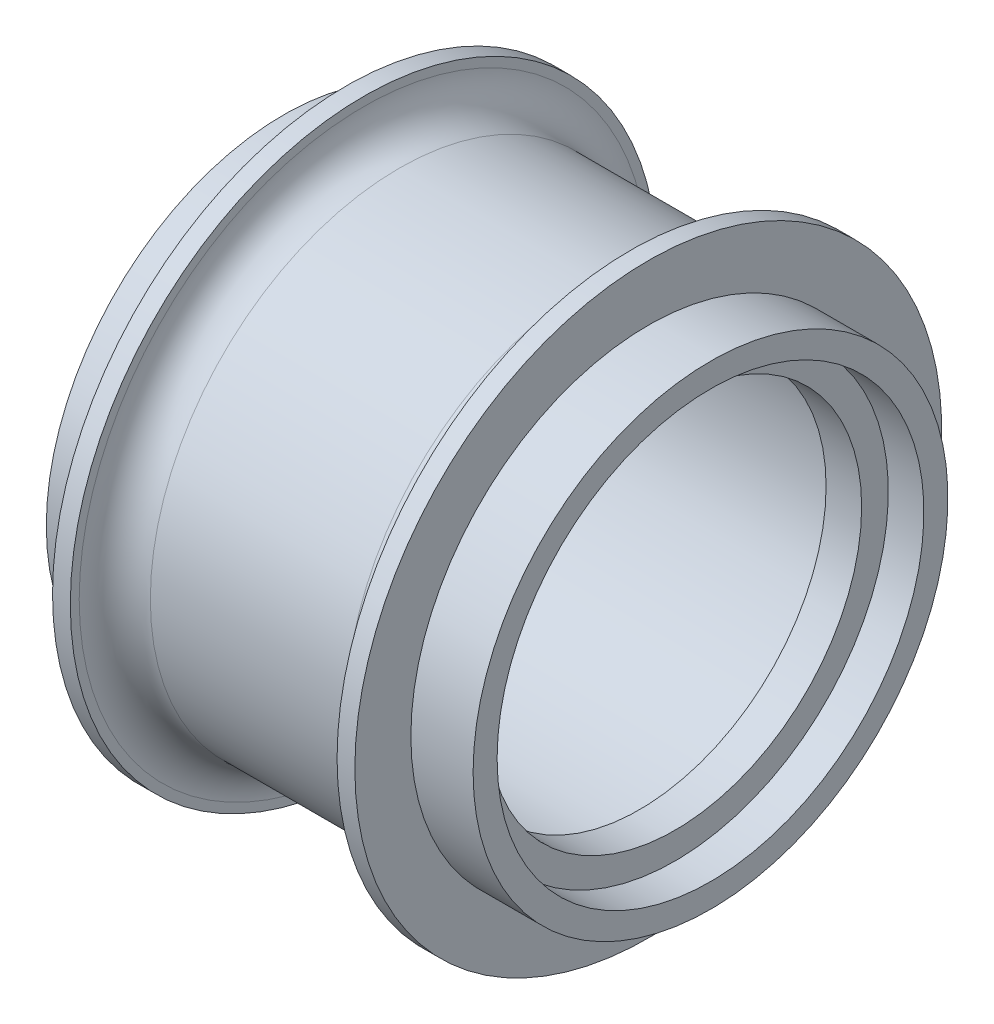
ISO-10303-21;
HEADER;
FILE_DESCRIPTION(('STEP AP214'),'2;1');
FILE_NAME('part.step','',(''),(''),'','','');
FILE_SCHEMA(('AUTOMOTIVE_DESIGN { 1 0 10303 214 1 1 1 1 }'));
ENDSEC;
DATA;
#1=APPLICATION_CONTEXT('core data for automotive mechanical design processes');
#2=APPLICATION_PROTOCOL_DEFINITION('international standard','automotive_design',2000,#1);
#3=PRODUCT_CONTEXT('',#1,'mechanical');
#4=PRODUCT('Part','Part','',(#3));
#5=PRODUCT_RELATED_PRODUCT_CATEGORY('part','',(#4));
#6=PRODUCT_DEFINITION_FORMATION('','',#4);
#7=PRODUCT_DEFINITION_CONTEXT('part definition',#1,'design');
#8=PRODUCT_DEFINITION('design','',#6,#7);
#9=PRODUCT_DEFINITION_SHAPE('','',#8);
#10=(LENGTH_UNIT() NAMED_UNIT(*) SI_UNIT(.MILLI.,.METRE.));
#11=(NAMED_UNIT(*) PLANE_ANGLE_UNIT() SI_UNIT($,.RADIAN.));
#12=(NAMED_UNIT(*) SI_UNIT($,.STERADIAN.) SOLID_ANGLE_UNIT());
#13=UNCERTAINTY_MEASURE_WITH_UNIT(LENGTH_MEASURE(1.E-05),#10,'distance_accuracy_value','');
#14=(GEOMETRIC_REPRESENTATION_CONTEXT(3) GLOBAL_UNCERTAINTY_ASSIGNED_CONTEXT((#13)) GLOBAL_UNIT_ASSIGNED_CONTEXT((#10,
#11,#12)) REPRESENTATION_CONTEXT('',''));
#15=CARTESIAN_POINT('',(0.,0.,0.));
#16=DIRECTION('',(0.,0.,1.));
#17=DIRECTION('',(1.,0.,0.));
#18=AXIS2_PLACEMENT_3D('',#15,#16,#17);
#19=CARTESIAN_POINT('',(-12.,12.,0.));
#20=DIRECTION('',(1.,0.,0.));
#21=DIRECTION('',(0.,0.,-1.));
#22=AXIS2_PLACEMENT_3D('',#19,#20,#21);
#23=PLANE('',#22);
#24=CARTESIAN_POINT('',(-12.,0.,0.));
#25=DIRECTION('',(-1.,0.,0.));
#26=DIRECTION('',(0.,0.,1.));
#27=AXIS2_PLACEMENT_3D('',#24,#25,#26);
#28=CIRCLE('',#27,12.);
#29=CARTESIAN_POINT('',(-12.,0.,12.));
#30=VERTEX_POINT('',#29);
#31=EDGE_CURVE('E10',#30,#30,#28,.T.);
#32=ORIENTED_EDGE('',*,*,#31,.F.);
#33=EDGE_LOOP('',(#32));
#34=FACE_BOUND('',#33,.T.);
#35=CARTESIAN_POINT('',(-12.,0.,0.));
#36=DIRECTION('',(-1.,0.,0.));
#37=DIRECTION('',(0.,0.,1.));
#38=AXIS2_PLACEMENT_3D('',#35,#36,#37);
#39=CIRCLE('',#38,13.35);
#40=CARTESIAN_POINT('',(-12.,0.,13.35));
#41=VERTEX_POINT('',#40);
#42=EDGE_CURVE('E104',#41,#41,#39,.T.);
#43=ORIENTED_EDGE('',*,*,#42,.T.);
#44=EDGE_LOOP('',(#43));
#45=FACE_BOUND('',#44,.T.);
#46=ADVANCED_FACE('F34',(#34,#45),#23,.F.);
#47=CARTESIAN_POINT('',(-7.00198598517657,0.,0.));
#48=DIRECTION('',(-1.,0.,0.));
#49=DIRECTION('',(0.,0.,1.));
#50=AXIS2_PLACEMENT_3D('',#47,#48,#49);
#51=CYLINDRICAL_SURFACE('',#50,12.);
#52=CARTESIAN_POINT('',(-9.3,0.,0.));
#53=DIRECTION('',(-1.,0.,0.));
#54=DIRECTION('',(0.,0.,1.));
#55=AXIS2_PLACEMENT_3D('',#52,#53,#54);
#56=CIRCLE('',#55,12.);
#57=CARTESIAN_POINT('',(-9.3,0.,12.));
#58=VERTEX_POINT('',#57);
#59=EDGE_CURVE('E40',#58,#58,#56,.T.);
#60=ORIENTED_EDGE('',*,*,#59,.F.);
#61=EDGE_LOOP('',(#60));
#62=FACE_BOUND('',#61,.T.);
#63=ORIENTED_EDGE('',*,*,#31,.T.);
#64=EDGE_LOOP('',(#63));
#65=FACE_BOUND('',#64,.T.);
#66=ADVANCED_FACE('F225',(#62,#65),#51,.F.);
#67=CARTESIAN_POINT('',(-9.3,12.,0.));
#68=DIRECTION('',(-1.,0.,0.));
#69=DIRECTION('',(0.,0.,1.));
#70=AXIS2_PLACEMENT_3D('',#67,#68,#69);
#71=PLANE('',#70);
#72=CARTESIAN_POINT('',(-9.3,0.,0.));
#73=DIRECTION('',(-1.,0.,0.));
#74=DIRECTION('',(0.,0.,1.));
#75=AXIS2_PLACEMENT_3D('',#72,#73,#74);
#76=CIRCLE('',#75,12.6);
#77=CARTESIAN_POINT('',(-9.3,0.,12.6));
#78=VERTEX_POINT('',#77);
#79=EDGE_CURVE('E44',#78,#78,#76,.T.);
#80=ORIENTED_EDGE('',*,*,#79,.F.);
#81=EDGE_LOOP('',(#80));
#82=FACE_BOUND('',#81,.T.);
#83=ORIENTED_EDGE('',*,*,#59,.T.);
#84=EDGE_LOOP('',(#83));
#85=FACE_BOUND('',#84,.T.);
#86=ADVANCED_FACE('F220',(#82,#85),#71,.F.);
#87=CARTESIAN_POINT('',(-7.00198598517657,0.,0.));
#88=DIRECTION('',(-1.,0.,0.));
#89=DIRECTION('',(0.,0.,1.));
#90=AXIS2_PLACEMENT_3D('',#87,#88,#89);
#91=CYLINDRICAL_SURFACE('',#90,12.6);
#92=CARTESIAN_POINT('',(-8.,0.,0.));
#93=DIRECTION('',(-1.,0.,0.));
#94=DIRECTION('',(0.,0.,1.));
#95=AXIS2_PLACEMENT_3D('',#92,#93,#94);
#96=CIRCLE('',#95,12.6);
#97=CARTESIAN_POINT('',(-8.,0.,12.6));
#98=VERTEX_POINT('',#97);
#99=EDGE_CURVE('E48',#98,#98,#96,.T.);
#100=ORIENTED_EDGE('',*,*,#99,.F.);
#101=EDGE_LOOP('',(#100));
#102=FACE_BOUND('',#101,.T.);
#103=ORIENTED_EDGE('',*,*,#79,.T.);
#104=EDGE_LOOP('',(#103));
#105=FACE_BOUND('',#104,.T.);
#106=ADVANCED_FACE('F214',(#102,#105),#91,.F.);
#107=CARTESIAN_POINT('',(-8.,12.6,0.));
#108=DIRECTION('',(1.,0.,0.));
#109=DIRECTION('',(0.,0.,-1.));
#110=AXIS2_PLACEMENT_3D('',#107,#108,#109);
#111=PLANE('',#110);
#112=CARTESIAN_POINT('',(-8.,0.,0.));
#113=DIRECTION('',(-1.,0.,0.));
#114=DIRECTION('',(0.,0.,1.));
#115=AXIS2_PLACEMENT_3D('',#112,#113,#114);
#116=CIRCLE('',#115,12.);
#117=CARTESIAN_POINT('',(-8.,0.,12.));
#118=VERTEX_POINT('',#117);
#119=EDGE_CURVE('E53',#118,#118,#116,.T.);
#120=ORIENTED_EDGE('',*,*,#119,.F.);
#121=EDGE_LOOP('',(#120));
#122=FACE_BOUND('',#121,.T.);
#123=ORIENTED_EDGE('',*,*,#99,.T.);
#124=EDGE_LOOP('',(#123));
#125=FACE_BOUND('',#124,.T.);
#126=ADVANCED_FACE('F208',(#122,#125),#111,.F.);
#127=CARTESIAN_POINT('',(-7.00198598517657,0.,0.));
#128=DIRECTION('',(-1.,0.,0.));
#129=DIRECTION('',(0.,0.,1.));
#130=AXIS2_PLACEMENT_3D('',#127,#128,#129);
#131=CYLINDRICAL_SURFACE('',#130,12.);
#132=CARTESIAN_POINT('',(8.,0.,0.));
#133=DIRECTION('',(-1.,0.,0.));
#134=DIRECTION('',(0.,0.,1.));
#135=AXIS2_PLACEMENT_3D('',#132,#133,#134);
#136=CIRCLE('',#135,12.);
#137=CARTESIAN_POINT('',(8.,0.,12.));
#138=VERTEX_POINT('',#137);
#139=EDGE_CURVE('E56',#138,#138,#136,.T.);
#140=ORIENTED_EDGE('',*,*,#139,.F.);
#141=EDGE_LOOP('',(#140));
#142=FACE_BOUND('',#141,.T.);
#143=ORIENTED_EDGE('',*,*,#119,.T.);
#144=EDGE_LOOP('',(#143));
#145=FACE_BOUND('',#144,.T.);
#146=ADVANCED_FACE('F202',(#142,#145),#131,.F.);
#147=CARTESIAN_POINT('',(8.,12.,0.));
#148=DIRECTION('',(1.,0.,0.));
#149=DIRECTION('',(0.,0.,-1.));
#150=AXIS2_PLACEMENT_3D('',#147,#148,#149);
#151=PLANE('',#150);
#152=CARTESIAN_POINT('',(8.,0.,0.));
#153=DIRECTION('',(-1.,0.,0.));
#154=DIRECTION('',(0.,0.,1.));
#155=AXIS2_PLACEMENT_3D('',#152,#153,#154);
#156=CIRCLE('',#155,10.5);
#157=CARTESIAN_POINT('',(8.,0.,10.5));
#158=VERTEX_POINT('',#157);
#159=EDGE_CURVE('E59',#158,#158,#156,.T.);
#160=ORIENTED_EDGE('',*,*,#159,.F.);
#161=EDGE_LOOP('',(#160));
#162=FACE_BOUND('',#161,.T.);
#163=ORIENTED_EDGE('',*,*,#139,.T.);
#164=EDGE_LOOP('',(#163));
#165=FACE_BOUND('',#164,.T.);
#166=ADVANCED_FACE('F196',(#162,#165),#151,.F.);
#167=CARTESIAN_POINT('',(-7.00198598517657,0.,0.));
#168=DIRECTION('',(-1.,0.,0.));
#169=DIRECTION('',(0.,0.,1.));
#170=AXIS2_PLACEMENT_3D('',#167,#168,#169);
#171=CYLINDRICAL_SURFACE('',#170,10.5);
#172=CARTESIAN_POINT('',(10.,0.,0.));
#173=DIRECTION('',(-1.,0.,0.));
#174=DIRECTION('',(0.,0.,1.));
#175=AXIS2_PLACEMENT_3D('',#172,#173,#174);
#176=CIRCLE('',#175,10.5);
#177=CARTESIAN_POINT('',(10.,0.,10.5));
#178=VERTEX_POINT('',#177);
#179=EDGE_CURVE('E62',#178,#178,#176,.T.);
#180=ORIENTED_EDGE('',*,*,#179,.F.);
#181=EDGE_LOOP('',(#180));
#182=FACE_BOUND('',#181,.T.);
#183=ORIENTED_EDGE('',*,*,#159,.T.);
#184=EDGE_LOOP('',(#183));
#185=FACE_BOUND('',#184,.T.);
#186=ADVANCED_FACE('F190',(#182,#185),#171,.F.);
#187=CARTESIAN_POINT('',(10.,10.5,0.));
#188=DIRECTION('',(-1.,0.,0.));
#189=DIRECTION('',(0.,0.,1.));
#190=AXIS2_PLACEMENT_3D('',#187,#188,#189);
#191=PLANE('',#190);
#192=CARTESIAN_POINT('',(10.,0.,0.));
#193=DIRECTION('',(-1.,0.,0.));
#194=DIRECTION('',(0.,0.,1.));
#195=AXIS2_PLACEMENT_3D('',#192,#193,#194);
#196=CIRCLE('',#195,12.);
#197=CARTESIAN_POINT('',(10.,0.,12.));
#198=VERTEX_POINT('',#197);
#199=EDGE_CURVE('E65',#198,#198,#196,.T.);
#200=ORIENTED_EDGE('',*,*,#199,.F.);
#201=EDGE_LOOP('',(#200));
#202=FACE_BOUND('',#201,.T.);
#203=ORIENTED_EDGE('',*,*,#179,.T.);
#204=EDGE_LOOP('',(#203));
#205=FACE_BOUND('',#204,.T.);
#206=ADVANCED_FACE('F184',(#202,#205),#191,.F.);
#207=CARTESIAN_POINT('',(-7.00198598517657,0.,0.));
#208=DIRECTION('',(-1.,0.,0.));
#209=DIRECTION('',(0.,0.,1.));
#210=AXIS2_PLACEMENT_3D('',#207,#208,#209);
#211=CYLINDRICAL_SURFACE('',#210,12.);
#212=CARTESIAN_POINT('',(12.,0.,0.));
#213=DIRECTION('',(-1.,0.,0.));
#214=DIRECTION('',(0.,0.,1.));
#215=AXIS2_PLACEMENT_3D('',#212,#213,#214);
#216=CIRCLE('',#215,12.);
#217=CARTESIAN_POINT('',(12.,0.,12.));
#218=VERTEX_POINT('',#217);
#219=EDGE_CURVE('E68',#218,#218,#216,.T.);
#220=ORIENTED_EDGE('',*,*,#219,.F.);
#221=EDGE_LOOP('',(#220));
#222=FACE_BOUND('',#221,.T.);
#223=ORIENTED_EDGE('',*,*,#199,.T.);
#224=EDGE_LOOP('',(#223));
#225=FACE_BOUND('',#224,.T.);
#226=ADVANCED_FACE('F178',(#222,#225),#211,.F.);
#227=CARTESIAN_POINT('',(12.,12.,0.));
#228=DIRECTION('',(-1.,0.,0.));
#229=DIRECTION('',(0.,0.,1.));
#230=AXIS2_PLACEMENT_3D('',#227,#228,#229);
#231=PLANE('',#230);
#232=CARTESIAN_POINT('',(12.,0.,0.));
#233=DIRECTION('',(-1.,0.,0.));
#234=DIRECTION('',(0.,0.,1.));
#235=AXIS2_PLACEMENT_3D('',#232,#233,#234);
#236=CIRCLE('',#235,13.35);
#237=CARTESIAN_POINT('',(12.,0.,13.35));
#238=VERTEX_POINT('',#237);
#239=EDGE_CURVE('E71',#238,#238,#236,.T.);
#240=ORIENTED_EDGE('',*,*,#239,.F.);
#241=EDGE_LOOP('',(#240));
#242=FACE_BOUND('',#241,.T.);
#243=ORIENTED_EDGE('',*,*,#219,.T.);
#244=EDGE_LOOP('',(#243));
#245=FACE_BOUND('',#244,.T.);
#246=ADVANCED_FACE('F172',(#242,#245),#231,.F.);
#247=CARTESIAN_POINT('',(-7.00198598517657,0.,0.));
#248=DIRECTION('',(-1.,0.,0.));
#249=DIRECTION('',(0.,0.,1.));
#250=AXIS2_PLACEMENT_3D('',#247,#248,#249);
#251=CYLINDRICAL_SURFACE('',#250,13.35);
#252=CARTESIAN_POINT('',(8.5,0.,0.));
#253=DIRECTION('',(-1.,0.,0.));
#254=DIRECTION('',(0.,0.,1.));
#255=AXIS2_PLACEMENT_3D('',#252,#253,#254);
#256=CIRCLE('',#255,13.35);
#257=CARTESIAN_POINT('',(8.5,0.,13.35));
#258=VERTEX_POINT('',#257);
#259=EDGE_CURVE('E74',#258,#258,#256,.T.);
#260=ORIENTED_EDGE('',*,*,#259,.F.);
#261=EDGE_LOOP('',(#260));
#262=FACE_BOUND('',#261,.T.);
#263=ORIENTED_EDGE('',*,*,#239,.T.);
#264=EDGE_LOOP('',(#263));
#265=FACE_BOUND('',#264,.T.);
#266=ADVANCED_FACE('F166',(#262,#265),#251,.T.);
#267=CARTESIAN_POINT('',(8.5,13.35,0.));
#268=DIRECTION('',(-1.,0.,0.));
#269=DIRECTION('',(0.,0.,1.));
#270=AXIS2_PLACEMENT_3D('',#267,#268,#269);
#271=PLANE('',#270);
#272=CARTESIAN_POINT('',(8.5,0.,0.));
#273=DIRECTION('',(-1.,0.,0.));
#274=DIRECTION('',(0.,0.,1.));
#275=AXIS2_PLACEMENT_3D('',#272,#273,#274);
#276=CIRCLE('',#275,16.5);
#277=CARTESIAN_POINT('',(8.5,0.,16.5));
#278=VERTEX_POINT('',#277);
#279=EDGE_CURVE('E77',#278,#278,#276,.T.);
#280=ORIENTED_EDGE('',*,*,#279,.F.);
#281=EDGE_LOOP('',(#280));
#282=FACE_BOUND('',#281,.T.);
#283=ORIENTED_EDGE('',*,*,#259,.T.);
#284=EDGE_LOOP('',(#283));
#285=FACE_BOUND('',#284,.T.);
#286=ADVANCED_FACE('F160',(#282,#285),#271,.F.);
#287=CARTESIAN_POINT('',(-7.00198598517657,0.,0.));
#288=DIRECTION('',(-1.,0.,0.));
#289=DIRECTION('',(0.,0.,1.));
#290=AXIS2_PLACEMENT_3D('',#287,#288,#289);
#291=CYLINDRICAL_SURFACE('',#290,16.5);
#292=CARTESIAN_POINT('',(7.5,0.,0.));
#293=DIRECTION('',(-1.,0.,0.));
#294=DIRECTION('',(0.,0.,1.));
#295=AXIS2_PLACEMENT_3D('',#292,#293,#294);
#296=CIRCLE('',#295,16.5);
#297=CARTESIAN_POINT('',(7.5,0.,16.5));
#298=VERTEX_POINT('',#297);
#299=EDGE_CURVE('E80',#298,#298,#296,.T.);
#300=ORIENTED_EDGE('',*,*,#299,.F.);
#301=EDGE_LOOP('',(#300));
#302=FACE_BOUND('',#301,.T.);
#303=ORIENTED_EDGE('',*,*,#279,.T.);
#304=EDGE_LOOP('',(#303));
#305=FACE_BOUND('',#304,.T.);
#306=ADVANCED_FACE('F154',(#302,#305),#291,.T.);
#307=CARTESIAN_POINT('',(7.5,16.,0.));
#308=DIRECTION('',(1.,0.,0.));
#309=DIRECTION('',(0.,0.,-1.));
#310=AXIS2_PLACEMENT_3D('',#307,#308,#309);
#311=PLANE('',#310);
#312=CARTESIAN_POINT('',(7.5,0.,0.));
#313=DIRECTION('',(-1.,0.,0.));
#314=DIRECTION('',(0.,0.,1.));
#315=AXIS2_PLACEMENT_3D('',#312,#313,#314);
#316=CIRCLE('',#315,16.);
#317=CARTESIAN_POINT('',(7.5,0.,16.));
#318=VERTEX_POINT('',#317);
#319=EDGE_CURVE('E83',#318,#318,#316,.T.);
#320=ORIENTED_EDGE('',*,*,#319,.F.);
#321=EDGE_LOOP('',(#320));
#322=FACE_BOUND('',#321,.T.);
#323=ORIENTED_EDGE('',*,*,#299,.T.);
#324=EDGE_LOOP('',(#323));
#325=FACE_BOUND('',#324,.T.);
#326=ADVANCED_FACE('F148',(#322,#325),#311,.F.);
#327=CARTESIAN_POINT('',(5.5,0.,0.));
#328=DIRECTION('',(-1.,0.,0.));
#329=DIRECTION('',(0.,0.,1.));
#330=AXIS2_PLACEMENT_3D('',#327,#328,#329);
#331=TOROIDAL_SURFACE('',#330,16.,2.);
#332=CARTESIAN_POINT('',(5.5,0.,0.));
#333=DIRECTION('',(-1.,0.,0.));
#334=DIRECTION('',(0.,0.,1.));
#335=AXIS2_PLACEMENT_3D('',#332,#333,#334);
#336=CIRCLE('',#335,14.);
#337=CARTESIAN_POINT('',(5.5,0.,14.));
#338=VERTEX_POINT('',#337);
#339=EDGE_CURVE('E86',#338,#338,#336,.T.);
#340=ORIENTED_EDGE('',*,*,#339,.F.);
#341=EDGE_LOOP('',(#340));
#342=FACE_BOUND('',#341,.T.);
#343=ORIENTED_EDGE('',*,*,#319,.T.);
#344=EDGE_LOOP('',(#343));
#345=FACE_BOUND('',#344,.T.);
#346=ADVANCED_FACE('F142',(#342,#345),#331,.F.);
#347=CARTESIAN_POINT('',(-7.00198598517657,0.,0.));
#348=DIRECTION('',(-1.,0.,0.));
#349=DIRECTION('',(0.,0.,1.));
#350=AXIS2_PLACEMENT_3D('',#347,#348,#349);
#351=CYLINDRICAL_SURFACE('',#350,14.);
#352=CARTESIAN_POINT('',(-5.5,0.,0.));
#353=DIRECTION('',(-1.,0.,0.));
#354=DIRECTION('',(0.,0.,1.));
#355=AXIS2_PLACEMENT_3D('',#352,#353,#354);
#356=CIRCLE('',#355,14.);
#357=CARTESIAN_POINT('',(-5.5,0.,14.));
#358=VERTEX_POINT('',#357);
#359=EDGE_CURVE('E89',#358,#358,#356,.T.);
#360=ORIENTED_EDGE('',*,*,#359,.F.);
#361=EDGE_LOOP('',(#360));
#362=FACE_BOUND('',#361,.T.);
#363=ORIENTED_EDGE('',*,*,#339,.T.);
#364=EDGE_LOOP('',(#363));
#365=FACE_BOUND('',#364,.T.);
#366=ADVANCED_FACE('F136',(#362,#365),#351,.T.);
#367=CARTESIAN_POINT('',(-5.5,0.,0.));
#368=DIRECTION('',(-1.,0.,0.));
#369=DIRECTION('',(0.,0.,1.));
#370=AXIS2_PLACEMENT_3D('',#367,#368,#369);
#371=TOROIDAL_SURFACE('',#370,16.,2.);
#372=CARTESIAN_POINT('',(-7.5,0.,0.));
#373=DIRECTION('',(-1.,0.,0.));
#374=DIRECTION('',(0.,0.,1.));
#375=AXIS2_PLACEMENT_3D('',#372,#373,#374);
#376=CIRCLE('',#375,16.);
#377=CARTESIAN_POINT('',(-7.5,0.,16.));
#378=VERTEX_POINT('',#377);
#379=EDGE_CURVE('E92',#378,#378,#376,.T.);
#380=ORIENTED_EDGE('',*,*,#379,.F.);
#381=EDGE_LOOP('',(#380));
#382=FACE_BOUND('',#381,.T.);
#383=ORIENTED_EDGE('',*,*,#359,.T.);
#384=EDGE_LOOP('',(#383));
#385=FACE_BOUND('',#384,.T.);
#386=ADVANCED_FACE('F130',(#382,#385),#371,.F.);
#387=CARTESIAN_POINT('',(-7.5,16.5,0.));
#388=DIRECTION('',(-1.,0.,0.));
#389=DIRECTION('',(0.,0.,1.));
#390=AXIS2_PLACEMENT_3D('',#387,#388,#389);
#391=PLANE('',#390);
#392=CARTESIAN_POINT('',(-7.5,0.,0.));
#393=DIRECTION('',(-1.,0.,0.));
#394=DIRECTION('',(0.,0.,1.));
#395=AXIS2_PLACEMENT_3D('',#392,#393,#394);
#396=CIRCLE('',#395,16.5);
#397=CARTESIAN_POINT('',(-7.5,0.,16.5));
#398=VERTEX_POINT('',#397);
#399=EDGE_CURVE('E95',#398,#398,#396,.T.);
#400=ORIENTED_EDGE('',*,*,#399,.F.);
#401=EDGE_LOOP('',(#400));
#402=FACE_BOUND('',#401,.T.);
#403=ORIENTED_EDGE('',*,*,#379,.T.);
#404=EDGE_LOOP('',(#403));
#405=FACE_BOUND('',#404,.T.);
#406=ADVANCED_FACE('F124',(#402,#405),#391,.F.);
#407=CARTESIAN_POINT('',(-7.00198598517657,0.,0.));
#408=DIRECTION('',(-1.,0.,0.));
#409=DIRECTION('',(0.,0.,1.));
#410=AXIS2_PLACEMENT_3D('',#407,#408,#409);
#411=CYLINDRICAL_SURFACE('',#410,16.5);
#412=CARTESIAN_POINT('',(-8.5,0.,0.));
#413=DIRECTION('',(-1.,0.,0.));
#414=DIRECTION('',(0.,0.,1.));
#415=AXIS2_PLACEMENT_3D('',#412,#413,#414);
#416=CIRCLE('',#415,16.5);
#417=CARTESIAN_POINT('',(-8.5,0.,16.5));
#418=VERTEX_POINT('',#417);
#419=EDGE_CURVE('E98',#418,#418,#416,.T.);
#420=ORIENTED_EDGE('',*,*,#419,.F.);
#421=EDGE_LOOP('',(#420));
#422=FACE_BOUND('',#421,.T.);
#423=ORIENTED_EDGE('',*,*,#399,.T.);
#424=EDGE_LOOP('',(#423));
#425=FACE_BOUND('',#424,.T.);
#426=ADVANCED_FACE('F118',(#422,#425),#411,.T.);
#427=CARTESIAN_POINT('',(-8.5,13.35,0.));
#428=DIRECTION('',(1.,0.,0.));
#429=DIRECTION('',(0.,0.,-1.));
#430=AXIS2_PLACEMENT_3D('',#427,#428,#429);
#431=PLANE('',#430);
#432=CARTESIAN_POINT('',(-8.5,0.,0.));
#433=DIRECTION('',(-1.,0.,0.));
#434=DIRECTION('',(0.,0.,1.));
#435=AXIS2_PLACEMENT_3D('',#432,#433,#434);
#436=CIRCLE('',#435,13.35);
#437=CARTESIAN_POINT('',(-8.5,0.,13.35));
#438=VERTEX_POINT('',#437);
#439=EDGE_CURVE('E101',#438,#438,#436,.T.);
#440=ORIENTED_EDGE('',*,*,#439,.F.);
#441=EDGE_LOOP('',(#440));
#442=FACE_BOUND('',#441,.T.);
#443=ORIENTED_EDGE('',*,*,#419,.T.);
#444=EDGE_LOOP('',(#443));
#445=FACE_BOUND('',#444,.T.);
#446=ADVANCED_FACE('F112',(#442,#445),#431,.F.);
#447=CARTESIAN_POINT('',(-7.00198598517657,0.,0.));
#448=DIRECTION('',(-1.,0.,0.));
#449=DIRECTION('',(0.,0.,1.));
#450=AXIS2_PLACEMENT_3D('',#447,#448,#449);
#451=CYLINDRICAL_SURFACE('',#450,13.35);
#452=ORIENTED_EDGE('',*,*,#42,.F.);
#453=EDGE_LOOP('',(#452));
#454=FACE_BOUND('',#453,.T.);
#455=ORIENTED_EDGE('',*,*,#439,.T.);
#456=EDGE_LOOP('',(#455));
#457=FACE_BOUND('',#456,.T.);
#458=ADVANCED_FACE('F109',(#454,#457),#451,.T.);
#459=CLOSED_SHELL('',(#46,#66,#86,#106,#126,#146,#166,#186,#206,#226,#246,#266,#286,#306,#326,
#346,#366,#386,#406,#426,#446,#458));
#460=MANIFOLD_SOLID_BREP('B2',#459);
#461=ADVANCED_BREP_SHAPE_REPRESENTATION('',(#18,#460),#14);
#462=SHAPE_DEFINITION_REPRESENTATION(#9,#461);
ENDSEC;
END-ISO-10303-21;
